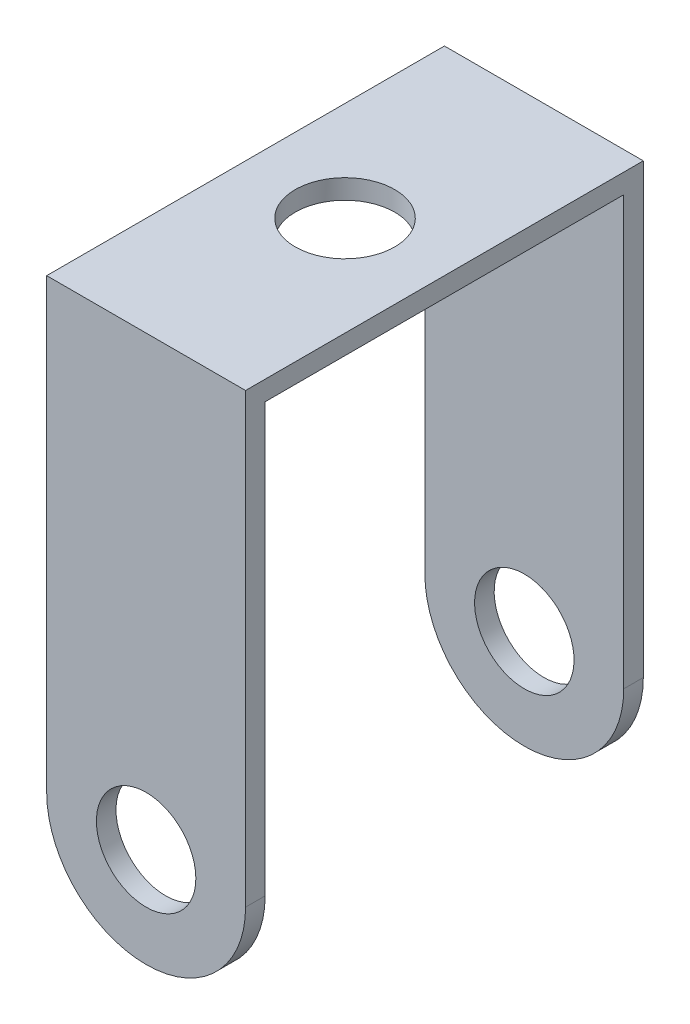
ISO-10303-21;
HEADER;
FILE_DESCRIPTION(('STEP AP214'),'2;1');
FILE_NAME('part.step','',(''),(''),'','','');
FILE_SCHEMA(('AUTOMOTIVE_DESIGN { 1 0 10303 214 1 1 1 1 }'));
ENDSEC;
DATA;
#1=APPLICATION_CONTEXT('core data for automotive mechanical design processes');
#2=APPLICATION_PROTOCOL_DEFINITION('international standard','automotive_design',2000,#1);
#3=PRODUCT_CONTEXT('',#1,'mechanical');
#4=PRODUCT('Part','Part','',(#3));
#5=PRODUCT_RELATED_PRODUCT_CATEGORY('part','',(#4));
#6=PRODUCT_DEFINITION_FORMATION('','',#4);
#7=PRODUCT_DEFINITION_CONTEXT('part definition',#1,'design');
#8=PRODUCT_DEFINITION('design','',#6,#7);
#9=PRODUCT_DEFINITION_SHAPE('','',#8);
#10=(LENGTH_UNIT() NAMED_UNIT(*) SI_UNIT(.MILLI.,.METRE.));
#11=(NAMED_UNIT(*) PLANE_ANGLE_UNIT() SI_UNIT($,.RADIAN.));
#12=(NAMED_UNIT(*) SI_UNIT($,.STERADIAN.) SOLID_ANGLE_UNIT());
#13=UNCERTAINTY_MEASURE_WITH_UNIT(LENGTH_MEASURE(1.E-05),#10,'distance_accuracy_value','');
#14=(GEOMETRIC_REPRESENTATION_CONTEXT(3) GLOBAL_UNCERTAINTY_ASSIGNED_CONTEXT((#13)) GLOBAL_UNIT_ASSIGNED_CONTEXT((#10,
#11,#12)) REPRESENTATION_CONTEXT('',''));
#15=CARTESIAN_POINT('',(0.,0.,0.));
#16=DIRECTION('',(0.,0.,1.));
#17=DIRECTION('',(1.,0.,0.));
#18=AXIS2_PLACEMENT_3D('',#15,#16,#17);
#19=CARTESIAN_POINT('',(0.,0.,50.8));
#20=DIRECTION('',(0.,0.,-1.));
#21=DIRECTION('',(-1.,0.,0.));
#22=AXIS2_PLACEMENT_3D('',#19,#20,#21);
#23=CYLINDRICAL_SURFACE('',#22,25.4);
#24=CARTESIAN_POINT('',(0.,0.,45.8));
#25=DIRECTION('',(0.,0.,1.));
#26=DIRECTION('',(0.,-1.,0.));
#27=AXIS2_PLACEMENT_3D('',#24,#25,#26);
#28=CIRCLE('',#27,25.4);
#29=CARTESIAN_POINT('',(-25.4,0.,45.8));
#30=VERTEX_POINT('',#29);
#31=CARTESIAN_POINT('',(25.4,0.,45.8));
#32=VERTEX_POINT('',#31);
#33=EDGE_CURVE('E137',#30,#32,#28,.T.);
#34=ORIENTED_EDGE('',*,*,#33,.T.);
#35=DIRECTION('',(0.,0.,-1.));
#36=VECTOR('',#35,1.);
#37=CARTESIAN_POINT('',(25.4,0.,50.8));
#38=LINE('',#37,#36);
#39=CARTESIAN_POINT('',(25.4,0.,50.8));
#40=VERTEX_POINT('',#39);
#41=EDGE_CURVE('E41',#40,#32,#38,.T.);
#42=ORIENTED_EDGE('',*,*,#41,.F.);
#43=CARTESIAN_POINT('',(0.,0.,50.8));
#44=DIRECTION('',(0.,0.,1.));
#45=DIRECTION('',(1.,0.,0.));
#46=AXIS2_PLACEMENT_3D('',#43,#44,#45);
#47=CIRCLE('',#46,25.4);
#48=CARTESIAN_POINT('',(-25.4,0.,50.8));
#49=VERTEX_POINT('',#48);
#50=EDGE_CURVE('E146',#49,#40,#47,.T.);
#51=ORIENTED_EDGE('',*,*,#50,.F.);
#52=DIRECTION('',(0.,0.,-1.));
#53=VECTOR('',#52,1.);
#54=CARTESIAN_POINT('',(-25.4,0.,50.8));
#55=LINE('',#54,#53);
#56=EDGE_CURVE('E159',#49,#30,#55,.T.);
#57=ORIENTED_EDGE('',*,*,#56,.T.);
#58=EDGE_LOOP('',(#34,#42,#51,#57));
#59=FACE_BOUND('',#58,.T.);
#60=ADVANCED_FACE('F32',(#59),#23,.T.);
#61=CARTESIAN_POINT('',(0.,0.,50.8));
#62=DIRECTION('',(0.,0.,-1.));
#63=DIRECTION('',(-1.,0.,0.));
#64=AXIS2_PLACEMENT_3D('',#61,#62,#63);
#65=CYLINDRICAL_SURFACE('',#64,12.7);
#66=CARTESIAN_POINT('',(0.,0.,45.8));
#67=DIRECTION('',(0.,0.,1.));
#68=DIRECTION('',(0.,-1.,0.));
#69=AXIS2_PLACEMENT_3D('',#66,#67,#68);
#70=CIRCLE('',#69,12.7);
#71=CARTESIAN_POINT('',(0.,-12.7,45.8));
#72=VERTEX_POINT('',#71);
#73=EDGE_CURVE('E133',#72,#72,#70,.T.);
#74=ORIENTED_EDGE('',*,*,#73,.F.);
#75=EDGE_LOOP('',(#74));
#76=FACE_BOUND('',#75,.T.);
#77=CARTESIAN_POINT('',(0.,0.,50.8));
#78=DIRECTION('',(0.,0.,1.));
#79=DIRECTION('',(1.,0.,0.));
#80=AXIS2_PLACEMENT_3D('',#77,#78,#79);
#81=CIRCLE('',#80,12.7);
#82=CARTESIAN_POINT('',(12.7,0.,50.8));
#83=VERTEX_POINT('',#82);
#84=EDGE_CURVE('E140',#83,#83,#81,.T.);
#85=ORIENTED_EDGE('',*,*,#84,.T.);
#86=EDGE_LOOP('',(#85));
#87=FACE_BOUND('',#86,.T.);
#88=ADVANCED_FACE('F178',(#76,#87),#65,.F.);
#89=CARTESIAN_POINT('',(0.,0.,50.8));
#90=DIRECTION('',(0.,0.,1.));
#91=DIRECTION('',(1.,0.,0.));
#92=AXIS2_PLACEMENT_3D('',#89,#90,#91);
#93=PLANE('',#92);
#94=ORIENTED_EDGE('',*,*,#50,.T.);
#95=DIRECTION('',(0.,1.,0.));
#96=VECTOR('',#95,1.);
#97=CARTESIAN_POINT('',(25.4,0.,50.8));
#98=LINE('',#97,#96);
#99=CARTESIAN_POINT('',(25.4,114.3,50.8));
#100=VERTEX_POINT('',#99);
#101=EDGE_CURVE('E87',#40,#100,#98,.T.);
#102=ORIENTED_EDGE('',*,*,#101,.T.);
#103=DIRECTION('',(-1.,0.,0.));
#104=VECTOR('',#103,1.);
#105=CARTESIAN_POINT('',(-25.4,114.3,50.8));
#106=LINE('',#105,#104);
#107=CARTESIAN_POINT('',(-25.4,114.3,50.8));
#108=VERTEX_POINT('',#107);
#109=EDGE_CURVE('E150',#100,#108,#106,.T.);
#110=ORIENTED_EDGE('',*,*,#109,.T.);
#111=DIRECTION('',(0.,-1.,0.));
#112=VECTOR('',#111,1.);
#113=CARTESIAN_POINT('',(-25.4,0.,50.8));
#114=LINE('',#113,#112);
#115=EDGE_CURVE('E57',#108,#49,#114,.T.);
#116=ORIENTED_EDGE('',*,*,#115,.T.);
#117=EDGE_LOOP('',(#94,#102,#110,#116));
#118=FACE_BOUND('',#117,.T.);
#119=ORIENTED_EDGE('',*,*,#84,.F.);
#120=EDGE_LOOP('',(#119));
#121=FACE_BOUND('',#120,.T.);
#122=ADVANCED_FACE('F181',(#118,#121),#93,.T.);
#123=CARTESIAN_POINT('',(0.,0.,-50.8));
#124=DIRECTION('',(0.,0.,1.));
#125=DIRECTION('',(1.,0.,0.));
#126=AXIS2_PLACEMENT_3D('',#123,#124,#125);
#127=PLANE('',#126);
#128=CARTESIAN_POINT('',(0.,0.,-50.8));
#129=DIRECTION('',(0.,0.,1.));
#130=DIRECTION('',(1.,0.,0.));
#131=AXIS2_PLACEMENT_3D('',#128,#129,#130);
#132=CIRCLE('',#131,25.4);
#133=CARTESIAN_POINT('',(-25.4,0.,-50.8));
#134=VERTEX_POINT('',#133);
#135=CARTESIAN_POINT('',(25.4,0.,-50.8));
#136=VERTEX_POINT('',#135);
#137=EDGE_CURVE('E143',#134,#136,#132,.T.);
#138=ORIENTED_EDGE('',*,*,#137,.F.);
#139=DIRECTION('',(0.,-1.,0.));
#140=VECTOR('',#139,1.);
#141=CARTESIAN_POINT('',(-25.4,0.,-50.8));
#142=LINE('',#141,#140);
#143=CARTESIAN_POINT('',(-25.4,114.3,-50.8));
#144=VERTEX_POINT('',#143);
#145=EDGE_CURVE('E148',#144,#134,#142,.T.);
#146=ORIENTED_EDGE('',*,*,#145,.F.);
#147=DIRECTION('',(-1.,0.,0.));
#148=VECTOR('',#147,1.);
#149=CARTESIAN_POINT('',(-25.4,114.3,-50.8));
#150=LINE('',#149,#148);
#151=CARTESIAN_POINT('',(25.4,114.3,-50.8));
#152=VERTEX_POINT('',#151);
#153=EDGE_CURVE('E156',#152,#144,#150,.T.);
#154=ORIENTED_EDGE('',*,*,#153,.F.);
#155=DIRECTION('',(0.,1.,0.));
#156=VECTOR('',#155,1.);
#157=CARTESIAN_POINT('',(25.4,0.,-50.8));
#158=LINE('',#157,#156);
#159=EDGE_CURVE('E154',#136,#152,#158,.T.);
#160=ORIENTED_EDGE('',*,*,#159,.F.);
#161=EDGE_LOOP('',(#138,#146,#154,#160));
#162=FACE_BOUND('',#161,.T.);
#163=CARTESIAN_POINT('',(0.,0.,-50.8));
#164=DIRECTION('',(0.,0.,1.));
#165=DIRECTION('',(1.,0.,0.));
#166=AXIS2_PLACEMENT_3D('',#163,#164,#165);
#167=CIRCLE('',#166,12.7);
#168=CARTESIAN_POINT('',(12.7,0.,-50.8));
#169=VERTEX_POINT('',#168);
#170=EDGE_CURVE('E139',#169,#169,#167,.T.);
#171=ORIENTED_EDGE('',*,*,#170,.T.);
#172=EDGE_LOOP('',(#171));
#173=FACE_BOUND('',#172,.T.);
#174=ADVANCED_FACE('F187',(#162,#173),#127,.F.);
#175=CARTESIAN_POINT('',(25.4,0.,-45.8));
#176=VERTEX_POINT('',#175);
#177=EDGE_CURVE('E168',#176,#136,#38,.T.);
#178=ORIENTED_EDGE('',*,*,#177,.F.);
#179=CARTESIAN_POINT('',(0.,0.,-45.8));
#180=DIRECTION('',(0.,0.,-1.));
#181=DIRECTION('',(0.,1.,0.));
#182=AXIS2_PLACEMENT_3D('',#179,#180,#181);
#183=CIRCLE('',#182,25.4);
#184=CARTESIAN_POINT('',(-25.4,0.,-45.8));
#185=VERTEX_POINT('',#184);
#186=EDGE_CURVE('E119',#176,#185,#183,.T.);
#187=ORIENTED_EDGE('',*,*,#186,.T.);
#188=EDGE_CURVE('E79',#185,#134,#55,.T.);
#189=ORIENTED_EDGE('',*,*,#188,.T.);
#190=ORIENTED_EDGE('',*,*,#137,.T.);
#191=EDGE_LOOP('',(#178,#187,#189,#190));
#192=FACE_BOUND('',#191,.T.);
#193=ADVANCED_FACE('F34',(#192),#23,.T.);
#194=CARTESIAN_POINT('',(25.4,0.,50.8));
#195=DIRECTION('',(-1.,0.,0.));
#196=DIRECTION('',(0.,-1.,0.));
#197=AXIS2_PLACEMENT_3D('',#194,#195,#196);
#198=PLANE('',#197);
#199=ORIENTED_EDGE('',*,*,#41,.T.);
#200=DIRECTION('',(0.,-1.,0.));
#201=VECTOR('',#200,1.);
#202=CARTESIAN_POINT('',(25.4,109.3,45.8));
#203=LINE('',#202,#201);
#204=CARTESIAN_POINT('',(25.4,109.3,45.8));
#205=VERTEX_POINT('',#204);
#206=EDGE_CURVE('E121',#205,#32,#203,.T.);
#207=ORIENTED_EDGE('',*,*,#206,.F.);
#208=DIRECTION('',(0.,0.,1.));
#209=VECTOR('',#208,1.);
#210=CARTESIAN_POINT('',(25.4,109.3,45.8));
#211=LINE('',#210,#209);
#212=CARTESIAN_POINT('',(25.4,109.3,-45.8));
#213=VERTEX_POINT('',#212);
#214=EDGE_CURVE('E111',#213,#205,#211,.T.);
#215=ORIENTED_EDGE('',*,*,#214,.F.);
#216=DIRECTION('',(0.,1.,0.));
#217=VECTOR('',#216,1.);
#218=CARTESIAN_POINT('',(25.4,109.3,-45.8));
#219=LINE('',#218,#217);
#220=EDGE_CURVE('E117',#176,#213,#219,.T.);
#221=ORIENTED_EDGE('',*,*,#220,.F.);
#222=ORIENTED_EDGE('',*,*,#177,.T.);
#223=ORIENTED_EDGE('',*,*,#159,.T.);
#224=DIRECTION('',(0.,0.,-1.));
#225=VECTOR('',#224,1.);
#226=CARTESIAN_POINT('',(25.4,114.3,50.8));
#227=LINE('',#226,#225);
#228=EDGE_CURVE('E165',#100,#152,#227,.T.);
#229=ORIENTED_EDGE('',*,*,#228,.F.);
#230=ORIENTED_EDGE('',*,*,#101,.F.);
#231=EDGE_LOOP('',(#199,#207,#215,#221,#222,#223,#229,#230));
#232=FACE_BOUND('',#231,.T.);
#233=ADVANCED_FACE('F123',(#232),#198,.F.);
#234=CARTESIAN_POINT('',(-25.4,114.3,50.8));
#235=DIRECTION('',(0.,-1.,0.));
#236=DIRECTION('',(0.,0.,-1.));
#237=AXIS2_PLACEMENT_3D('',#234,#235,#236);
#238=PLANE('',#237);
#239=CARTESIAN_POINT('',(0.,114.3,0.));
#240=DIRECTION('',(0.,1.,0.));
#241=DIRECTION('',(0.,0.,1.));
#242=AXIS2_PLACEMENT_3D('',#239,#240,#241);
#243=CIRCLE('',#242,12.7);
#244=CARTESIAN_POINT('',(0.,114.3,12.7));
#245=VERTEX_POINT('',#244);
#246=EDGE_CURVE('E216',#245,#245,#243,.T.);
#247=ORIENTED_EDGE('',*,*,#246,.F.);
#248=EDGE_LOOP('',(#247));
#249=FACE_BOUND('',#248,.T.);
#250=ORIENTED_EDGE('',*,*,#153,.T.);
#251=DIRECTION('',(0.,0.,-1.));
#252=VECTOR('',#251,1.);
#253=CARTESIAN_POINT('',(-25.4,114.3,50.8));
#254=LINE('',#253,#252);
#255=EDGE_CURVE('E162',#108,#144,#254,.T.);
#256=ORIENTED_EDGE('',*,*,#255,.F.);
#257=ORIENTED_EDGE('',*,*,#109,.F.);
#258=ORIENTED_EDGE('',*,*,#228,.T.);
#259=EDGE_LOOP('',(#250,#256,#257,#258));
#260=FACE_BOUND('',#259,.T.);
#261=ADVANCED_FACE('F202',(#249,#260),#238,.F.);
#262=CARTESIAN_POINT('',(-25.4,0.,50.8));
#263=DIRECTION('',(1.,0.,0.));
#264=DIRECTION('',(0.,0.,-1.));
#265=AXIS2_PLACEMENT_3D('',#262,#263,#264);
#266=PLANE('',#265);
#267=DIRECTION('',(0.,0.,1.));
#268=VECTOR('',#267,1.);
#269=CARTESIAN_POINT('',(-25.4,109.3,50.8));
#270=LINE('',#269,#268);
#271=CARTESIAN_POINT('',(-25.4,109.3,-45.8));
#272=VERTEX_POINT('',#271);
#273=CARTESIAN_POINT('',(-25.4,109.3,45.8));
#274=VERTEX_POINT('',#273);
#275=EDGE_CURVE('E11',#272,#274,#270,.T.);
#276=ORIENTED_EDGE('',*,*,#275,.T.);
#277=DIRECTION('',(0.,-1.,0.));
#278=VECTOR('',#277,1.);
#279=CARTESIAN_POINT('',(-25.4,0.,45.8));
#280=LINE('',#279,#278);
#281=EDGE_CURVE('E134',#274,#30,#280,.T.);
#282=ORIENTED_EDGE('',*,*,#281,.T.);
#283=ORIENTED_EDGE('',*,*,#56,.F.);
#284=ORIENTED_EDGE('',*,*,#115,.F.);
#285=ORIENTED_EDGE('',*,*,#255,.T.);
#286=ORIENTED_EDGE('',*,*,#145,.T.);
#287=ORIENTED_EDGE('',*,*,#188,.F.);
#288=DIRECTION('',(0.,1.,0.));
#289=VECTOR('',#288,1.);
#290=CARTESIAN_POINT('',(-25.4,0.,-45.8));
#291=LINE('',#290,#289);
#292=EDGE_CURVE('E130',#185,#272,#291,.T.);
#293=ORIENTED_EDGE('',*,*,#292,.T.);
#294=EDGE_LOOP('',(#276,#282,#283,#284,#285,#286,#287,#293));
#295=FACE_BOUND('',#294,.T.);
#296=ADVANCED_FACE('F212',(#295),#266,.F.);
#297=CARTESIAN_POINT('',(0.,0.,-45.8));
#298=DIRECTION('',(0.,0.,-1.));
#299=DIRECTION('',(0.,1.,0.));
#300=AXIS2_PLACEMENT_3D('',#297,#298,#299);
#301=CIRCLE('',#300,12.7);
#302=CARTESIAN_POINT('',(0.,12.7,-45.8));
#303=VERTEX_POINT('',#302);
#304=EDGE_CURVE('E128',#303,#303,#301,.T.);
#305=ORIENTED_EDGE('',*,*,#304,.F.);
#306=EDGE_LOOP('',(#305));
#307=FACE_BOUND('',#306,.T.);
#308=ORIENTED_EDGE('',*,*,#170,.F.);
#309=EDGE_LOOP('',(#308));
#310=FACE_BOUND('',#309,.T.);
#311=ADVANCED_FACE('F183',(#307,#310),#65,.F.);
#312=CARTESIAN_POINT('',(-76.2,109.3,45.8));
#313=DIRECTION('',(0.,1.,0.));
#314=DIRECTION('',(-1.,0.,0.));
#315=AXIS2_PLACEMENT_3D('',#312,#313,#314);
#316=PLANE('',#315);
#317=CARTESIAN_POINT('',(0.,109.3,0.));
#318=DIRECTION('',(0.,1.,0.));
#319=DIRECTION('',(-1.,0.,0.));
#320=AXIS2_PLACEMENT_3D('',#317,#318,#319);
#321=CIRCLE('',#320,12.7);
#322=CARTESIAN_POINT('',(-12.7,109.3,0.));
#323=VERTEX_POINT('',#322);
#324=EDGE_CURVE('E36',#323,#323,#321,.T.);
#325=ORIENTED_EDGE('',*,*,#324,.T.);
#326=EDGE_LOOP('',(#325));
#327=FACE_BOUND('',#326,.T.);
#328=DIRECTION('',(1.,0.,0.));
#329=VECTOR('',#328,1.);
#330=CARTESIAN_POINT('',(-76.2,109.3,-45.8));
#331=LINE('',#330,#329);
#332=EDGE_CURVE('E48',#272,#213,#331,.T.);
#333=ORIENTED_EDGE('',*,*,#332,.T.);
#334=ORIENTED_EDGE('',*,*,#214,.T.);
#335=DIRECTION('',(1.,0.,0.));
#336=VECTOR('',#335,1.);
#337=CARTESIAN_POINT('',(-76.2,109.3,45.8));
#338=LINE('',#337,#336);
#339=EDGE_CURVE('E114',#274,#205,#338,.T.);
#340=ORIENTED_EDGE('',*,*,#339,.F.);
#341=ORIENTED_EDGE('',*,*,#275,.F.);
#342=EDGE_LOOP('',(#333,#334,#340,#341));
#343=FACE_BOUND('',#342,.T.);
#344=ADVANCED_FACE('F108',(#327,#343),#316,.F.);
#345=CARTESIAN_POINT('',(-76.2,109.3,45.8));
#346=DIRECTION('',(0.,0.,1.));
#347=DIRECTION('',(0.,-1.,0.));
#348=AXIS2_PLACEMENT_3D('',#345,#346,#347);
#349=PLANE('',#348);
#350=ORIENTED_EDGE('',*,*,#73,.T.);
#351=EDGE_LOOP('',(#350));
#352=FACE_BOUND('',#351,.T.);
#353=ORIENTED_EDGE('',*,*,#33,.F.);
#354=ORIENTED_EDGE('',*,*,#281,.F.);
#355=ORIENTED_EDGE('',*,*,#339,.T.);
#356=ORIENTED_EDGE('',*,*,#206,.T.);
#357=EDGE_LOOP('',(#353,#354,#355,#356));
#358=FACE_BOUND('',#357,.T.);
#359=ADVANCED_FACE('F175',(#352,#358),#349,.F.);
#360=CARTESIAN_POINT('',(-76.2,109.3,-45.8));
#361=DIRECTION('',(0.,0.,-1.));
#362=DIRECTION('',(0.,1.,0.));
#363=AXIS2_PLACEMENT_3D('',#360,#361,#362);
#364=PLANE('',#363);
#365=ORIENTED_EDGE('',*,*,#304,.T.);
#366=EDGE_LOOP('',(#365));
#367=FACE_BOUND('',#366,.T.);
#368=ORIENTED_EDGE('',*,*,#220,.T.);
#369=ORIENTED_EDGE('',*,*,#332,.F.);
#370=ORIENTED_EDGE('',*,*,#292,.F.);
#371=ORIENTED_EDGE('',*,*,#186,.F.);
#372=EDGE_LOOP('',(#368,#369,#370,#371));
#373=FACE_BOUND('',#372,.T.);
#374=ADVANCED_FACE('F118',(#367,#373),#364,.F.);
#375=CARTESIAN_POINT('',(0.,12.7,0.));
#376=DIRECTION('',(0.,1.,0.));
#377=DIRECTION('',(0.,0.,1.));
#378=AXIS2_PLACEMENT_3D('',#375,#376,#377);
#379=CYLINDRICAL_SURFACE('',#378,12.7);
#380=ORIENTED_EDGE('',*,*,#246,.T.);
#381=EDGE_LOOP('',(#380));
#382=FACE_BOUND('',#381,.T.);
#383=ORIENTED_EDGE('',*,*,#324,.F.);
#384=EDGE_LOOP('',(#383));
#385=FACE_BOUND('',#384,.T.);
#386=ADVANCED_FACE('F221',(#382,#385),#379,.F.);
#387=CLOSED_SHELL('',(#60,#88,#122,#174,#193,#233,#261,#296,#311,#344,#359,#374,#386));
#388=MANIFOLD_SOLID_BREP('B2',#387);
#389=ADVANCED_BREP_SHAPE_REPRESENTATION('',(#18,#388),#14);
#390=SHAPE_DEFINITION_REPRESENTATION(#9,#389);
ENDSEC;
END-ISO-10303-21;
